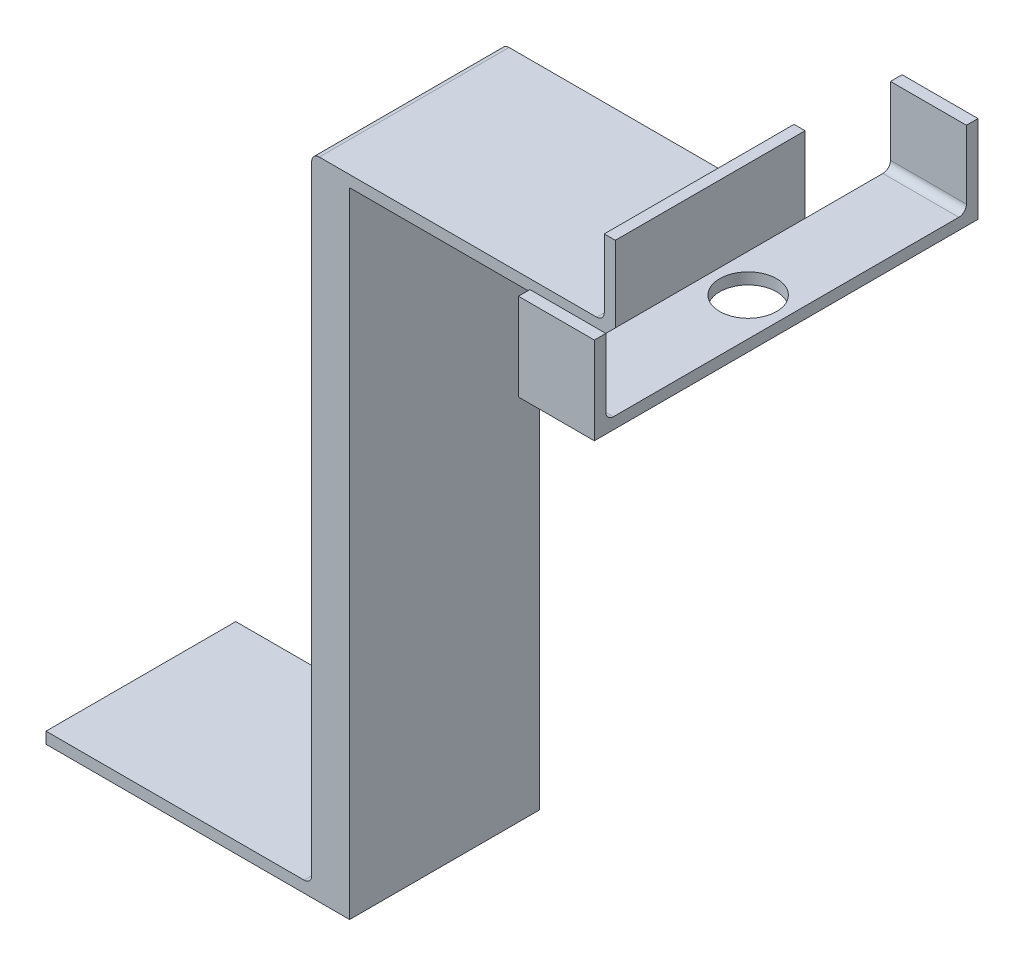
ISO-10303-21;
HEADER;
FILE_DESCRIPTION(('STEP AP214'),'2;1');
FILE_NAME('part.step','',(''),(''),'','','');
FILE_SCHEMA(('AUTOMOTIVE_DESIGN { 1 0 10303 214 1 1 1 1 }'));
ENDSEC;
DATA;
#1=APPLICATION_CONTEXT('core data for automotive mechanical design processes');
#2=APPLICATION_PROTOCOL_DEFINITION('international standard','automotive_design',2000,#1);
#3=PRODUCT_CONTEXT('',#1,'mechanical');
#4=PRODUCT('Part','Part','',(#3));
#5=PRODUCT_RELATED_PRODUCT_CATEGORY('part','',(#4));
#6=PRODUCT_DEFINITION_FORMATION('','',#4);
#7=PRODUCT_DEFINITION_CONTEXT('part definition',#1,'design');
#8=PRODUCT_DEFINITION('design','',#6,#7);
#9=PRODUCT_DEFINITION_SHAPE('','',#8);
#10=(LENGTH_UNIT() NAMED_UNIT(*) SI_UNIT(.MILLI.,.METRE.));
#11=(NAMED_UNIT(*) PLANE_ANGLE_UNIT() SI_UNIT($,.RADIAN.));
#12=(NAMED_UNIT(*) SI_UNIT($,.STERADIAN.) SOLID_ANGLE_UNIT());
#13=UNCERTAINTY_MEASURE_WITH_UNIT(LENGTH_MEASURE(1.E-05),#10,'distance_accuracy_value','');
#14=(GEOMETRIC_REPRESENTATION_CONTEXT(3) GLOBAL_UNCERTAINTY_ASSIGNED_CONTEXT((#13)) GLOBAL_UNIT_ASSIGNED_CONTEXT((#10,
#11,#12)) REPRESENTATION_CONTEXT('',''));
#15=CARTESIAN_POINT('',(0.,0.,0.));
#16=DIRECTION('',(0.,0.,1.));
#17=DIRECTION('',(1.,0.,0.));
#18=AXIS2_PLACEMENT_3D('',#15,#16,#17);
#19=CARTESIAN_POINT('',(0.,215.9,0.));
#20=DIRECTION('',(0.,-1.,0.));
#21=DIRECTION('',(0.,0.,-1.));
#22=AXIS2_PLACEMENT_3D('',#19,#20,#21);
#23=PLANE('',#22);
#24=CARTESIAN_POINT('',(203.2,215.9,31.75));
#25=DIRECTION('',(0.,1.,0.));
#26=DIRECTION('',(0.,0.,1.));
#27=AXIS2_PLACEMENT_3D('',#24,#25,#26);
#28=CIRCLE('',#27,9.525);
#29=CARTESIAN_POINT('',(203.2,215.9,41.275));
#30=VERTEX_POINT('',#29);
#31=EDGE_CURVE('E252',#30,#30,#28,.T.);
#32=ORIENTED_EDGE('',*,*,#31,.F.);
#33=EDGE_LOOP('',(#32));
#34=FACE_BOUND('',#33,.T.);
#35=DIRECTION('',(0.,0.,1.));
#36=VECTOR('',#35,1.);
#37=CARTESIAN_POINT('',(190.5,215.9,92.075));
#38=LINE('',#37,#36);
#39=CARTESIAN_POINT('',(190.5,215.9,63.5));
#40=VERTEX_POINT('',#39);
#41=CARTESIAN_POINT('',(190.5,215.9,89.535));
#42=VERTEX_POINT('',#41);
#43=EDGE_CURVE('E264',#40,#42,#38,.T.);
#44=ORIENTED_EDGE('',*,*,#43,.T.);
#45=DIRECTION('',(-1.,0.,0.));
#46=VECTOR('',#45,1.);
#47=CARTESIAN_POINT('',(215.9,215.9,89.535));
#48=LINE('',#47,#46);
#49=CARTESIAN_POINT('',(215.9,215.9,89.535));
#50=VERTEX_POINT('',#49);
#51=EDGE_CURVE('E362',#42,#50,#48,.F.);
#52=ORIENTED_EDGE('',*,*,#51,.T.);
#53=DIRECTION('',(0.,0.,-1.));
#54=VECTOR('',#53,1.);
#55=CARTESIAN_POINT('',(215.9,215.9,-28.575));
#56=LINE('',#55,#54);
#57=CARTESIAN_POINT('',(215.9,215.9,-26.035));
#58=VERTEX_POINT('',#57);
#59=EDGE_CURVE('E281',#50,#58,#56,.T.);
#60=ORIENTED_EDGE('',*,*,#59,.T.);
#61=DIRECTION('',(-1.,0.,0.));
#62=VECTOR('',#61,1.);
#63=CARTESIAN_POINT('',(190.5,215.9,-26.035));
#64=LINE('',#63,#62);
#65=CARTESIAN_POINT('',(190.5,215.9,-26.035));
#66=VERTEX_POINT('',#65);
#67=EDGE_CURVE('E359',#58,#66,#64,.T.);
#68=ORIENTED_EDGE('',*,*,#67,.T.);
#69=DIRECTION('',(0.,0.,1.));
#70=VECTOR('',#69,1.);
#71=CARTESIAN_POINT('',(190.5,215.9,-28.575));
#72=LINE('',#71,#70);
#73=CARTESIAN_POINT('',(190.5,215.9,0.));
#74=VERTEX_POINT('',#73);
#75=EDGE_CURVE('E271',#66,#74,#72,.T.);
#76=ORIENTED_EDGE('',*,*,#75,.T.);
#77=DIRECTION('',(0.,0.,-1.));
#78=VECTOR('',#77,1.);
#79=CARTESIAN_POINT('',(190.5,215.9,0.));
#80=LINE('',#79,#78);
#81=EDGE_CURVE('E249',#40,#74,#80,.T.);
#82=ORIENTED_EDGE('',*,*,#81,.F.);
#83=EDGE_LOOP('',(#44,#52,#60,#68,#76,#82));
#84=FACE_BOUND('',#83,.T.);
#85=ADVANCED_FACE('F37',(#34,#84),#23,.F.);
#86=CARTESIAN_POINT('',(215.9,241.3,-28.575));
#87=DIRECTION('',(0.,0.,-1.));
#88=DIRECTION('',(-1.,0.,0.));
#89=AXIS2_PLACEMENT_3D('',#86,#87,#88);
#90=PLANE('',#89);
#91=DIRECTION('',(0.,-1.,0.));
#92=VECTOR('',#91,1.);
#93=CARTESIAN_POINT('',(190.5,241.3,-28.575));
#94=LINE('',#93,#92);
#95=CARTESIAN_POINT('',(190.5,241.3,-28.575));
#96=VERTEX_POINT('',#95);
#97=CARTESIAN_POINT('',(190.5,218.44,-28.575));
#98=VERTEX_POINT('',#97);
#99=EDGE_CURVE('E341',#96,#98,#94,.T.);
#100=ORIENTED_EDGE('',*,*,#99,.T.);
#101=DIRECTION('',(-1.,0.,0.));
#102=VECTOR('',#101,1.);
#103=CARTESIAN_POINT('',(215.9,218.44,-28.575));
#104=LINE('',#103,#102);
#105=CARTESIAN_POINT('',(215.9,218.44,-28.575));
#106=VERTEX_POINT('',#105);
#107=EDGE_CURVE('E364',#98,#106,#104,.F.);
#108=ORIENTED_EDGE('',*,*,#107,.T.);
#109=DIRECTION('',(0.,-1.,0.));
#110=VECTOR('',#109,1.);
#111=CARTESIAN_POINT('',(215.9,241.3,-28.575));
#112=LINE('',#111,#110);
#113=CARTESIAN_POINT('',(215.9,241.3,-28.575));
#114=VERTEX_POINT('',#113);
#115=EDGE_CURVE('E344',#114,#106,#112,.T.);
#116=ORIENTED_EDGE('',*,*,#115,.F.);
#117=DIRECTION('',(1.,0.,0.));
#118=VECTOR('',#117,1.);
#119=CARTESIAN_POINT('',(215.9,241.3,-28.575));
#120=LINE('',#119,#118);
#121=EDGE_CURVE('E347',#96,#114,#120,.T.);
#122=ORIENTED_EDGE('',*,*,#121,.F.);
#123=EDGE_LOOP('',(#100,#108,#116,#122));
#124=FACE_BOUND('',#123,.T.);
#125=ADVANCED_FACE('F459',(#124),#90,.F.);
#126=CARTESIAN_POINT('',(215.9,241.3,-28.575));
#127=DIRECTION('',(-1.,0.,0.));
#128=DIRECTION('',(0.,0.,1.));
#129=AXIS2_PLACEMENT_3D('',#126,#127,#128);
#130=PLANE('',#129);
#131=ORIENTED_EDGE('',*,*,#115,.T.);
#132=CARTESIAN_POINT('',(215.9,218.44,-26.035));
#133=DIRECTION('',(-1.,0.,0.));
#134=DIRECTION('',(0.,0.,1.));
#135=AXIS2_PLACEMENT_3D('',#132,#133,#134);
#136=CIRCLE('',#135,2.54);
#137=EDGE_CURVE('E390',#106,#58,#136,.T.);
#138=ORIENTED_EDGE('',*,*,#137,.T.);
#139=ORIENTED_EDGE('',*,*,#59,.F.);
#140=CARTESIAN_POINT('',(215.9,218.44,89.535));
#141=DIRECTION('',(-1.,0.,0.));
#142=DIRECTION('',(0.,0.,1.));
#143=AXIS2_PLACEMENT_3D('',#140,#141,#142);
#144=CIRCLE('',#143,2.54);
#145=CARTESIAN_POINT('',(215.9,218.44,92.075));
#146=VERTEX_POINT('',#145);
#147=EDGE_CURVE('E386',#50,#146,#144,.T.);
#148=ORIENTED_EDGE('',*,*,#147,.T.);
#149=DIRECTION('',(0.,-1.,0.));
#150=VECTOR('',#149,1.);
#151=CARTESIAN_POINT('',(215.9,241.3,92.075));
#152=LINE('',#151,#150);
#153=CARTESIAN_POINT('',(215.9,241.3,92.075));
#154=VERTEX_POINT('',#153);
#155=EDGE_CURVE('E231',#154,#146,#152,.T.);
#156=ORIENTED_EDGE('',*,*,#155,.F.);
#157=DIRECTION('',(0.,0.,-1.));
#158=VECTOR('',#157,1.);
#159=CARTESIAN_POINT('',(215.9,241.3,92.075));
#160=LINE('',#159,#158);
#161=CARTESIAN_POINT('',(215.9,241.3,95.9160839160832));
#162=VERTEX_POINT('',#161);
#163=EDGE_CURVE('E219',#162,#154,#160,.T.);
#164=ORIENTED_EDGE('',*,*,#163,.F.);
#165=DIRECTION('',(0.,1.,0.));
#166=VECTOR('',#165,1.);
#167=CARTESIAN_POINT('',(215.9,212.09,95.9160839160832));
#168=LINE('',#167,#166);
#169=CARTESIAN_POINT('',(215.9,212.09,95.9160839160832));
#170=VERTEX_POINT('',#169);
#171=EDGE_CURVE('E211',#170,#162,#168,.T.);
#172=ORIENTED_EDGE('',*,*,#171,.F.);
#173=DIRECTION('',(0.,0.,1.));
#174=VECTOR('',#173,1.);
#175=CARTESIAN_POINT('',(215.9,212.09,-32.4607336475015));
#176=LINE('',#175,#174);
#177=CARTESIAN_POINT('',(215.9,212.09,-32.4607336475015));
#178=VERTEX_POINT('',#177);
#179=EDGE_CURVE('E329',#178,#170,#176,.T.);
#180=ORIENTED_EDGE('',*,*,#179,.F.);
#181=DIRECTION('',(0.,-1.,0.));
#182=VECTOR('',#181,1.);
#183=CARTESIAN_POINT('',(215.9,241.3,-32.4607336475015));
#184=LINE('',#183,#182);
#185=CARTESIAN_POINT('',(215.9,241.3,-32.4607336475015));
#186=VERTEX_POINT('',#185);
#187=EDGE_CURVE('E337',#186,#178,#184,.T.);
#188=ORIENTED_EDGE('',*,*,#187,.F.);
#189=DIRECTION('',(0.,0.,-1.));
#190=VECTOR('',#189,1.);
#191=CARTESIAN_POINT('',(215.9,241.3,-28.575));
#192=LINE('',#191,#190);
#193=EDGE_CURVE('E353',#114,#186,#192,.T.);
#194=ORIENTED_EDGE('',*,*,#193,.F.);
#195=EDGE_LOOP('',(#131,#138,#139,#148,#156,#164,#172,#180,#188,#194));
#196=FACE_BOUND('',#195,.T.);
#197=ADVANCED_FACE('F446',(#196),#130,.F.);
#198=CARTESIAN_POINT('',(215.9,241.3,-32.4607336475015));
#199=DIRECTION('',(0.,0.,1.));
#200=DIRECTION('',(1.,0.,0.));
#201=AXIS2_PLACEMENT_3D('',#198,#199,#200);
#202=PLANE('',#201);
#203=ORIENTED_EDGE('',*,*,#187,.T.);
#204=DIRECTION('',(1.,0.,0.));
#205=VECTOR('',#204,1.);
#206=CARTESIAN_POINT('',(215.9,212.09,-32.4607336475015));
#207=LINE('',#206,#205);
#208=CARTESIAN_POINT('',(190.5,212.09,-32.4607336475015));
#209=VERTEX_POINT('',#208);
#210=EDGE_CURVE('E334',#209,#178,#207,.T.);
#211=ORIENTED_EDGE('',*,*,#210,.F.);
#212=DIRECTION('',(0.,-1.,0.));
#213=VECTOR('',#212,1.);
#214=CARTESIAN_POINT('',(190.5,241.3,-32.4607336475015));
#215=LINE('',#214,#213);
#216=CARTESIAN_POINT('',(190.5,241.3,-32.4607336475015));
#217=VERTEX_POINT('',#216);
#218=EDGE_CURVE('E339',#217,#209,#215,.T.);
#219=ORIENTED_EDGE('',*,*,#218,.F.);
#220=DIRECTION('',(-1.,0.,0.));
#221=VECTOR('',#220,1.);
#222=CARTESIAN_POINT('',(215.9,241.3,-32.4607336475015));
#223=LINE('',#222,#221);
#224=EDGE_CURVE('E351',#186,#217,#223,.T.);
#225=ORIENTED_EDGE('',*,*,#224,.F.);
#226=EDGE_LOOP('',(#203,#211,#219,#225));
#227=FACE_BOUND('',#226,.T.);
#228=ADVANCED_FACE('F473',(#227),#202,.F.);
#229=CARTESIAN_POINT('',(190.5,241.3,-28.575));
#230=DIRECTION('',(1.,0.,0.));
#231=DIRECTION('',(0.,0.,-1.));
#232=AXIS2_PLACEMENT_3D('',#229,#230,#231);
#233=PLANE('',#232);
#234=ORIENTED_EDGE('',*,*,#218,.T.);
#235=DIRECTION('',(0.,0.,-1.));
#236=VECTOR('',#235,1.);
#237=CARTESIAN_POINT('',(190.5,212.09,-32.4607336475015));
#238=LINE('',#237,#236);
#239=CARTESIAN_POINT('',(190.5,212.09,0.));
#240=VERTEX_POINT('',#239);
#241=EDGE_CURVE('E331',#240,#209,#238,.T.);
#242=ORIENTED_EDGE('',*,*,#241,.F.);
#243=DIRECTION('',(0.,1.,0.));
#244=VECTOR('',#243,1.);
#245=CARTESIAN_POINT('',(190.5,212.09,0.));
#246=LINE('',#245,#244);
#247=EDGE_CURVE('E285',#240,#74,#246,.T.);
#248=ORIENTED_EDGE('',*,*,#247,.T.);
#249=ORIENTED_EDGE('',*,*,#75,.F.);
#250=CARTESIAN_POINT('',(190.5,218.44,-26.035));
#251=DIRECTION('',(1.,0.,0.));
#252=DIRECTION('',(0.,0.,-1.));
#253=AXIS2_PLACEMENT_3D('',#250,#251,#252);
#254=CIRCLE('',#253,2.54);
#255=EDGE_CURVE('E388',#66,#98,#254,.T.);
#256=ORIENTED_EDGE('',*,*,#255,.T.);
#257=ORIENTED_EDGE('',*,*,#99,.F.);
#258=DIRECTION('',(0.,0.,1.));
#259=VECTOR('',#258,1.);
#260=CARTESIAN_POINT('',(190.5,241.3,-28.575));
#261=LINE('',#260,#259);
#262=EDGE_CURVE('E349',#217,#96,#261,.T.);
#263=ORIENTED_EDGE('',*,*,#262,.F.);
#264=EDGE_LOOP('',(#234,#242,#248,#249,#256,#257,#263));
#265=FACE_BOUND('',#264,.T.);
#266=ADVANCED_FACE('F455',(#265),#233,.F.);
#267=CARTESIAN_POINT('',(0.,241.3,0.));
#268=DIRECTION('',(0.,1.,0.));
#269=DIRECTION('',(0.,0.,1.));
#270=AXIS2_PLACEMENT_3D('',#267,#268,#269);
#271=PLANE('',#270);
#272=ORIENTED_EDGE('',*,*,#193,.T.);
#273=ORIENTED_EDGE('',*,*,#224,.T.);
#274=ORIENTED_EDGE('',*,*,#262,.T.);
#275=ORIENTED_EDGE('',*,*,#121,.T.);
#276=EDGE_LOOP('',(#272,#273,#274,#275));
#277=FACE_BOUND('',#276,.T.);
#278=ADVANCED_FACE('F463',(#277),#271,.T.);
#279=CARTESIAN_POINT('',(0.,212.09,0.));
#280=DIRECTION('',(0.,-1.,0.));
#281=DIRECTION('',(0.,0.,-1.));
#282=AXIS2_PLACEMENT_3D('',#279,#280,#281);
#283=PLANE('',#282);
#284=ORIENTED_EDGE('',*,*,#179,.T.);
#285=DIRECTION('',(-1.,0.,0.));
#286=VECTOR('',#285,1.);
#287=CARTESIAN_POINT('',(190.5,212.09,95.9160839160832));
#288=LINE('',#287,#286);
#289=CARTESIAN_POINT('',(190.5,212.09,95.9160839160832));
#290=VERTEX_POINT('',#289);
#291=EDGE_CURVE('E210',#170,#290,#288,.T.);
#292=ORIENTED_EDGE('',*,*,#291,.T.);
#293=DIRECTION('',(0.,0.,1.));
#294=VECTOR('',#293,1.);
#295=CARTESIAN_POINT('',(190.5,212.09,92.075));
#296=LINE('',#295,#294);
#297=CARTESIAN_POINT('',(190.5,212.09,63.5));
#298=VERTEX_POINT('',#297);
#299=EDGE_CURVE('E206',#298,#290,#296,.T.);
#300=ORIENTED_EDGE('',*,*,#299,.F.);
#301=DIRECTION('',(1.,0.,0.));
#302=VECTOR('',#301,1.);
#303=CARTESIAN_POINT('',(101.6,212.09,63.5));
#304=LINE('',#303,#302);
#305=CARTESIAN_POINT('',(101.6,212.09,63.5));
#306=VERTEX_POINT('',#305);
#307=EDGE_CURVE('E270',#306,#298,#304,.T.);
#308=ORIENTED_EDGE('',*,*,#307,.F.);
#309=DIRECTION('',(0.,0.,1.));
#310=VECTOR('',#309,1.);
#311=CARTESIAN_POINT('',(101.6,212.09,0.));
#312=LINE('',#311,#310);
#313=CARTESIAN_POINT('',(101.6,212.09,0.));
#314=VERTEX_POINT('',#313);
#315=EDGE_CURVE('E267',#314,#306,#312,.T.);
#316=ORIENTED_EDGE('',*,*,#315,.F.);
#317=DIRECTION('',(-1.,0.,0.));
#318=VECTOR('',#317,1.);
#319=CARTESIAN_POINT('',(101.6,212.09,0.));
#320=LINE('',#319,#318);
#321=EDGE_CURVE('E275',#240,#314,#320,.T.);
#322=ORIENTED_EDGE('',*,*,#321,.F.);
#323=ORIENTED_EDGE('',*,*,#241,.T.);
#324=ORIENTED_EDGE('',*,*,#210,.T.);
#325=EDGE_LOOP('',(#284,#292,#300,#308,#316,#322,#323,#324));
#326=FACE_BOUND('',#325,.T.);
#327=CARTESIAN_POINT('',(203.2,212.09,31.75));
#328=DIRECTION('',(0.,1.,0.));
#329=DIRECTION('',(0.,0.,1.));
#330=AXIS2_PLACEMENT_3D('',#327,#328,#329);
#331=CIRCLE('',#330,9.525);
#332=CARTESIAN_POINT('',(203.2,212.09,41.275));
#333=VERTEX_POINT('',#332);
#334=EDGE_CURVE('E261',#333,#333,#331,.T.);
#335=ORIENTED_EDGE('',*,*,#334,.T.);
#336=EDGE_LOOP('',(#335));
#337=FACE_BOUND('',#336,.T.);
#338=ADVANCED_FACE('F470',(#326,#337),#283,.T.);
#339=DIRECTION('',(1.,0.,0.));
#340=VECTOR('',#339,1.);
#341=CARTESIAN_POINT('',(101.6,215.9,63.5));
#342=LINE('',#341,#340);
#343=CARTESIAN_POINT('',(91.44,215.9,63.5));
#344=VERTEX_POINT('',#343);
#345=CARTESIAN_POINT('',(184.259133749134,215.9,63.5));
#346=VERTEX_POINT('',#345);
#347=EDGE_CURVE('E293',#344,#346,#342,.T.);
#348=ORIENTED_EDGE('',*,*,#347,.T.);
#349=DIRECTION('',(0.,0.,1.));
#350=VECTOR('',#349,1.);
#351=CARTESIAN_POINT('',(184.259133749134,215.9,0.));
#352=LINE('',#351,#350);
#353=CARTESIAN_POINT('',(184.259133749134,215.9,0.));
#354=VERTEX_POINT('',#353);
#355=EDGE_CURVE('E372',#346,#354,#352,.F.);
#356=ORIENTED_EDGE('',*,*,#355,.T.);
#357=DIRECTION('',(-1.,0.,0.));
#358=VECTOR('',#357,1.);
#359=CARTESIAN_POINT('',(101.6,215.9,0.));
#360=LINE('',#359,#358);
#361=CARTESIAN_POINT('',(91.44,215.9,0.));
#362=VERTEX_POINT('',#361);
#363=EDGE_CURVE('E288',#354,#362,#360,.T.);
#364=ORIENTED_EDGE('',*,*,#363,.T.);
#365=DIRECTION('',(0.,0.,1.));
#366=VECTOR('',#365,1.);
#367=CARTESIAN_POINT('',(91.44,215.9,0.));
#368=LINE('',#367,#366);
#369=EDGE_CURVE('E369',#362,#344,#368,.T.);
#370=ORIENTED_EDGE('',*,*,#369,.T.);
#371=EDGE_LOOP('',(#348,#356,#364,#370));
#372=FACE_BOUND('',#371,.T.);
#373=ADVANCED_FACE('F414',(#372),#23,.F.);
#374=CARTESIAN_POINT('',(0.,3.80999999999999,0.));
#375=DIRECTION('',(1.,0.,0.));
#376=DIRECTION('',(0.,0.,-1.));
#377=AXIS2_PLACEMENT_3D('',#374,#375,#376);
#378=PLANE('',#377);
#379=DIRECTION('',(0.,0.,1.));
#380=VECTOR('',#379,1.);
#381=CARTESIAN_POINT('',(0.,0.,0.));
#382=LINE('',#381,#380);
#383=CARTESIAN_POINT('',(0.,0.,0.));
#384=VERTEX_POINT('',#383);
#385=CARTESIAN_POINT('',(0.,0.,63.5));
#386=VERTEX_POINT('',#385);
#387=EDGE_CURVE('E301',#384,#386,#382,.T.);
#388=ORIENTED_EDGE('',*,*,#387,.T.);
#389=DIRECTION('',(0.,-1.,0.));
#390=VECTOR('',#389,1.);
#391=CARTESIAN_POINT('',(0.,3.80999999999999,63.5));
#392=LINE('',#391,#390);
#393=CARTESIAN_POINT('',(0.,3.80999999999999,63.5));
#394=VERTEX_POINT('',#393);
#395=EDGE_CURVE('E326',#394,#386,#392,.T.);
#396=ORIENTED_EDGE('',*,*,#395,.F.);
#397=DIRECTION('',(0.,0.,1.));
#398=VECTOR('',#397,1.);
#399=CARTESIAN_POINT('',(0.,3.80999999999999,0.));
#400=LINE('',#399,#398);
#401=CARTESIAN_POINT('',(0.,3.80999999999999,0.));
#402=VERTEX_POINT('',#401);
#403=EDGE_CURVE('E302',#402,#394,#400,.T.);
#404=ORIENTED_EDGE('',*,*,#403,.F.);
#405=DIRECTION('',(0.,-1.,0.));
#406=VECTOR('',#405,1.);
#407=CARTESIAN_POINT('',(0.,3.80999999999999,0.));
#408=LINE('',#407,#406);
#409=EDGE_CURVE('E310',#402,#384,#408,.T.);
#410=ORIENTED_EDGE('',*,*,#409,.T.);
#411=EDGE_LOOP('',(#388,#396,#404,#410));
#412=FACE_BOUND('',#411,.T.);
#413=ADVANCED_FACE('F484',(#412),#378,.F.);
#414=CARTESIAN_POINT('',(0.,3.80999999999999,63.5));
#415=DIRECTION('',(0.,0.,-1.));
#416=DIRECTION('',(-1.,0.,0.));
#417=AXIS2_PLACEMENT_3D('',#414,#415,#416);
#418=PLANE('',#417);
#419=ORIENTED_EDGE('',*,*,#347,.F.);
#420=CARTESIAN_POINT('',(91.44,213.36,63.5));
#421=DIRECTION('',(0.,0.,-1.));
#422=DIRECTION('',(-1.,0.,0.));
#423=AXIS2_PLACEMENT_3D('',#420,#421,#422);
#424=CIRCLE('',#423,2.54);
#425=CARTESIAN_POINT('',(88.9,213.36,63.5));
#426=VERTEX_POINT('',#425);
#427=EDGE_CURVE('E374',#344,#426,#424,.F.);
#428=ORIENTED_EDGE('',*,*,#427,.T.);
#429=DIRECTION('',(0.,-1.,0.));
#430=VECTOR('',#429,1.);
#431=CARTESIAN_POINT('',(88.9,215.9,63.5));
#432=LINE('',#431,#430);
#433=CARTESIAN_POINT('',(88.9,6.35000000000005,63.5));
#434=VERTEX_POINT('',#433);
#435=EDGE_CURVE('E296',#426,#434,#432,.T.);
#436=ORIENTED_EDGE('',*,*,#435,.T.);
#437=CARTESIAN_POINT('',(86.36,6.34999999999999,63.5));
#438=DIRECTION('',(0.,0.,-1.));
#439=DIRECTION('',(-1.,0.,0.));
#440=AXIS2_PLACEMENT_3D('',#437,#438,#439);
#441=CIRCLE('',#440,2.54);
#442=CARTESIAN_POINT('',(86.36,3.80999999999999,63.5));
#443=VERTEX_POINT('',#442);
#444=EDGE_CURVE('E45',#434,#443,#441,.T.);
#445=ORIENTED_EDGE('',*,*,#444,.T.);
#446=DIRECTION('',(1.,0.,0.));
#447=VECTOR('',#446,1.);
#448=CARTESIAN_POINT('',(0.,3.80999999999999,63.5));
#449=LINE('',#448,#447);
#450=EDGE_CURVE('E305',#394,#443,#449,.T.);
#451=ORIENTED_EDGE('',*,*,#450,.F.);
#452=ORIENTED_EDGE('',*,*,#395,.T.);
#453=DIRECTION('',(1.,0.,0.));
#454=VECTOR('',#453,1.);
#455=CARTESIAN_POINT('',(0.,0.,63.5));
#456=LINE('',#455,#454);
#457=CARTESIAN_POINT('',(101.6,0.,63.5));
#458=VERTEX_POINT('',#457);
#459=EDGE_CURVE('E313',#386,#458,#456,.T.);
#460=ORIENTED_EDGE('',*,*,#459,.T.);
#461=DIRECTION('',(0.,-1.,0.));
#462=VECTOR('',#461,1.);
#463=CARTESIAN_POINT('',(101.6,3.80999999999999,63.5));
#464=LINE('',#463,#462);
#465=EDGE_CURVE('E324',#306,#458,#464,.T.);
#466=ORIENTED_EDGE('',*,*,#465,.F.);
#467=ORIENTED_EDGE('',*,*,#307,.T.);
#468=DIRECTION('',(0.,1.,0.));
#469=VECTOR('',#468,1.);
#470=CARTESIAN_POINT('',(190.5,212.09,63.5));
#471=LINE('',#470,#469);
#472=EDGE_CURVE('E278',#298,#40,#471,.T.);
#473=ORIENTED_EDGE('',*,*,#472,.T.);
#474=DIRECTION('',(0.,-1.,0.));
#475=VECTOR('',#474,1.);
#476=CARTESIAN_POINT('',(190.5,241.3,63.5));
#477=LINE('',#476,#475);
#478=CARTESIAN_POINT('',(190.5,241.3,63.5));
#479=VERTEX_POINT('',#478);
#480=EDGE_CURVE('E242',#479,#40,#477,.T.);
#481=ORIENTED_EDGE('',*,*,#480,.F.);
#482=DIRECTION('',(1.,0.,0.));
#483=VECTOR('',#482,1.);
#484=CARTESIAN_POINT('',(190.5,241.3,63.5));
#485=LINE('',#484,#483);
#486=CARTESIAN_POINT('',(186.799133749134,241.3,63.5));
#487=VERTEX_POINT('',#486);
#488=EDGE_CURVE('E255',#487,#479,#485,.T.);
#489=ORIENTED_EDGE('',*,*,#488,.F.);
#490=DIRECTION('',(0.,-1.,0.));
#491=VECTOR('',#490,1.);
#492=CARTESIAN_POINT('',(186.799133749134,241.3,63.5));
#493=LINE('',#492,#491);
#494=CARTESIAN_POINT('',(186.799133749134,218.44,63.5));
#495=VERTEX_POINT('',#494);
#496=EDGE_CURVE('E239',#487,#495,#493,.T.);
#497=ORIENTED_EDGE('',*,*,#496,.T.);
#498=CARTESIAN_POINT('',(184.259133749134,218.44,63.5));
#499=DIRECTION('',(0.,0.,-1.));
#500=DIRECTION('',(-1.,0.,0.));
#501=AXIS2_PLACEMENT_3D('',#498,#499,#500);
#502=CIRCLE('',#501,2.54);
#503=EDGE_CURVE('E392',#495,#346,#502,.T.);
#504=ORIENTED_EDGE('',*,*,#503,.T.);
#505=EDGE_LOOP('',(#419,#428,#436,#445,#451,#452,#460,#466,#467,#473,#481,#489,#497,#504));
#506=FACE_BOUND('',#505,.T.);
#507=ADVANCED_FACE('F397',(#506),#418,.F.);
#508=CARTESIAN_POINT('',(101.6,3.80999999999999,0.));
#509=DIRECTION('',(-1.,0.,0.));
#510=DIRECTION('',(0.,0.,1.));
#511=AXIS2_PLACEMENT_3D('',#508,#509,#510);
#512=PLANE('',#511);
#513=DIRECTION('',(0.,-1.,0.));
#514=VECTOR('',#513,1.);
#515=CARTESIAN_POINT('',(101.6,3.80999999999999,0.));
#516=LINE('',#515,#514);
#517=CARTESIAN_POINT('',(101.6,0.,0.));
#518=VERTEX_POINT('',#517);
#519=EDGE_CURVE('E322',#314,#518,#516,.T.);
#520=ORIENTED_EDGE('',*,*,#519,.F.);
#521=ORIENTED_EDGE('',*,*,#315,.T.);
#522=ORIENTED_EDGE('',*,*,#465,.T.);
#523=DIRECTION('',(0.,0.,-1.));
#524=VECTOR('',#523,1.);
#525=CARTESIAN_POINT('',(101.6,0.,0.));
#526=LINE('',#525,#524);
#527=EDGE_CURVE('E316',#458,#518,#526,.T.);
#528=ORIENTED_EDGE('',*,*,#527,.T.);
#529=EDGE_LOOP('',(#520,#521,#522,#528));
#530=FACE_BOUND('',#529,.T.);
#531=ADVANCED_FACE('F476',(#530),#512,.F.);
#532=CARTESIAN_POINT('',(0.,3.80999999999999,0.));
#533=DIRECTION('',(0.,0.,1.));
#534=DIRECTION('',(1.,0.,0.));
#535=AXIS2_PLACEMENT_3D('',#532,#533,#534);
#536=PLANE('',#535);
#537=DIRECTION('',(0.,-1.,0.));
#538=VECTOR('',#537,1.);
#539=CARTESIAN_POINT('',(88.9,215.9,0.));
#540=LINE('',#539,#538);
#541=CARTESIAN_POINT('',(88.9,213.36,0.));
#542=VERTEX_POINT('',#541);
#543=CARTESIAN_POINT('',(88.9,6.35000000000005,0.));
#544=VERTEX_POINT('',#543);
#545=EDGE_CURVE('E299',#542,#544,#540,.T.);
#546=ORIENTED_EDGE('',*,*,#545,.F.);
#547=CARTESIAN_POINT('',(91.44,213.36,0.));
#548=DIRECTION('',(0.,0.,1.));
#549=DIRECTION('',(1.,0.,0.));
#550=AXIS2_PLACEMENT_3D('',#547,#548,#549);
#551=CIRCLE('',#550,2.54);
#552=EDGE_CURVE('E381',#542,#362,#551,.F.);
#553=ORIENTED_EDGE('',*,*,#552,.T.);
#554=ORIENTED_EDGE('',*,*,#363,.F.);
#555=CARTESIAN_POINT('',(184.259133749134,218.44,0.));
#556=DIRECTION('',(0.,0.,1.));
#557=DIRECTION('',(1.,0.,0.));
#558=AXIS2_PLACEMENT_3D('',#555,#556,#557);
#559=CIRCLE('',#558,2.54);
#560=CARTESIAN_POINT('',(186.799133749134,218.44,0.));
#561=VERTEX_POINT('',#560);
#562=EDGE_CURVE('E394',#354,#561,#559,.T.);
#563=ORIENTED_EDGE('',*,*,#562,.T.);
#564=DIRECTION('',(0.,-1.,0.));
#565=VECTOR('',#564,1.);
#566=CARTESIAN_POINT('',(186.799133749134,241.3,0.));
#567=LINE('',#566,#565);
#568=CARTESIAN_POINT('',(186.799133749134,241.3,0.));
#569=VERTEX_POINT('',#568);
#570=EDGE_CURVE('E236',#569,#561,#567,.T.);
#571=ORIENTED_EDGE('',*,*,#570,.F.);
#572=DIRECTION('',(-1.,0.,0.));
#573=VECTOR('',#572,1.);
#574=CARTESIAN_POINT('',(186.799133749134,241.3,0.));
#575=LINE('',#574,#573);
#576=CARTESIAN_POINT('',(190.5,241.3,0.));
#577=VERTEX_POINT('',#576);
#578=EDGE_CURVE('E253',#577,#569,#575,.T.);
#579=ORIENTED_EDGE('',*,*,#578,.F.);
#580=DIRECTION('',(0.,-1.,0.));
#581=VECTOR('',#580,1.);
#582=CARTESIAN_POINT('',(190.5,241.3,0.));
#583=LINE('',#582,#581);
#584=EDGE_CURVE('E245',#577,#74,#583,.T.);
#585=ORIENTED_EDGE('',*,*,#584,.T.);
#586=ORIENTED_EDGE('',*,*,#247,.F.);
#587=ORIENTED_EDGE('',*,*,#321,.T.);
#588=ORIENTED_EDGE('',*,*,#519,.T.);
#589=DIRECTION('',(-1.,0.,0.));
#590=VECTOR('',#589,1.);
#591=CARTESIAN_POINT('',(0.,0.,0.));
#592=LINE('',#591,#590);
#593=EDGE_CURVE('E306',#518,#384,#592,.T.);
#594=ORIENTED_EDGE('',*,*,#593,.T.);
#595=ORIENTED_EDGE('',*,*,#409,.F.);
#596=DIRECTION('',(-1.,0.,0.));
#597=VECTOR('',#596,1.);
#598=CARTESIAN_POINT('',(0.,3.80999999999999,0.));
#599=LINE('',#598,#597);
#600=CARTESIAN_POINT('',(86.36,3.80999999999999,0.));
#601=VERTEX_POINT('',#600);
#602=EDGE_CURVE('E308',#601,#402,#599,.T.);
#603=ORIENTED_EDGE('',*,*,#602,.F.);
#604=CARTESIAN_POINT('',(86.36,6.34999999999999,0.));
#605=DIRECTION('',(0.,0.,1.));
#606=DIRECTION('',(1.,0.,0.));
#607=AXIS2_PLACEMENT_3D('',#604,#605,#606);
#608=CIRCLE('',#607,2.54);
#609=EDGE_CURVE('E11',#601,#544,#608,.T.);
#610=ORIENTED_EDGE('',*,*,#609,.T.);
#611=EDGE_LOOP('',(#546,#553,#554,#563,#571,#579,#585,#586,#587,#588,#594,#595,#603,#610));
#612=FACE_BOUND('',#611,.T.);
#613=ADVANCED_FACE('F408',(#612),#536,.F.);
#614=CARTESIAN_POINT('',(0.,3.80999999999999,0.));
#615=DIRECTION('',(0.,1.,0.));
#616=DIRECTION('',(0.,0.,1.));
#617=AXIS2_PLACEMENT_3D('',#614,#615,#616);
#618=PLANE('',#617);
#619=ORIENTED_EDGE('',*,*,#450,.T.);
#620=DIRECTION('',(0.,0.,1.));
#621=VECTOR('',#620,1.);
#622=CARTESIAN_POINT('',(86.36,3.80999999999999,0.));
#623=LINE('',#622,#621);
#624=EDGE_CURVE('E52',#443,#601,#623,.F.);
#625=ORIENTED_EDGE('',*,*,#624,.T.);
#626=ORIENTED_EDGE('',*,*,#602,.T.);
#627=ORIENTED_EDGE('',*,*,#403,.T.);
#628=EDGE_LOOP('',(#619,#625,#626,#627));
#629=FACE_BOUND('',#628,.T.);
#630=ADVANCED_FACE('F401',(#629),#618,.T.);
#631=CARTESIAN_POINT('',(0.,0.,0.));
#632=DIRECTION('',(0.,1.,0.));
#633=DIRECTION('',(0.,0.,1.));
#634=AXIS2_PLACEMENT_3D('',#631,#632,#633);
#635=PLANE('',#634);
#636=ORIENTED_EDGE('',*,*,#387,.F.);
#637=ORIENTED_EDGE('',*,*,#593,.F.);
#638=ORIENTED_EDGE('',*,*,#527,.F.);
#639=ORIENTED_EDGE('',*,*,#459,.F.);
#640=EDGE_LOOP('',(#636,#637,#638,#639));
#641=FACE_BOUND('',#640,.T.);
#642=ADVANCED_FACE('F481',(#641),#635,.F.);
#643=CARTESIAN_POINT('',(88.9,215.9,0.));
#644=DIRECTION('',(1.,0.,0.));
#645=DIRECTION('',(0.,0.,-1.));
#646=AXIS2_PLACEMENT_3D('',#643,#644,#645);
#647=PLANE('',#646);
#648=ORIENTED_EDGE('',*,*,#435,.F.);
#649=DIRECTION('',(0.,0.,1.));
#650=VECTOR('',#649,1.);
#651=CARTESIAN_POINT('',(88.9,213.36,0.));
#652=LINE('',#651,#650);
#653=EDGE_CURVE('E379',#426,#542,#652,.F.);
#654=ORIENTED_EDGE('',*,*,#653,.T.);
#655=ORIENTED_EDGE('',*,*,#545,.T.);
#656=DIRECTION('',(0.,0.,1.));
#657=VECTOR('',#656,1.);
#658=CARTESIAN_POINT('',(88.9,6.34999999999999,0.));
#659=LINE('',#658,#657);
#660=EDGE_CURVE('E376',#544,#434,#659,.T.);
#661=ORIENTED_EDGE('',*,*,#660,.T.);
#662=EDGE_LOOP('',(#648,#654,#655,#661));
#663=FACE_BOUND('',#662,.T.);
#664=ADVANCED_FACE('F405',(#663),#647,.F.);
#665=CARTESIAN_POINT('',(190.5,212.09,92.075));
#666=DIRECTION('',(-1.,0.,0.));
#667=DIRECTION('',(0.,0.,1.));
#668=AXIS2_PLACEMENT_3D('',#665,#666,#667);
#669=PLANE('',#668);
#670=ORIENTED_EDGE('',*,*,#43,.F.);
#671=ORIENTED_EDGE('',*,*,#472,.F.);
#672=ORIENTED_EDGE('',*,*,#299,.T.);
#673=DIRECTION('',(0.,1.,0.));
#674=VECTOR('',#673,1.);
#675=CARTESIAN_POINT('',(190.5,212.09,95.9160839160832));
#676=LINE('',#675,#674);
#677=CARTESIAN_POINT('',(190.5,241.3,95.9160839160832));
#678=VERTEX_POINT('',#677);
#679=EDGE_CURVE('E198',#290,#678,#676,.T.);
#680=ORIENTED_EDGE('',*,*,#679,.T.);
#681=DIRECTION('',(0.,0.,1.));
#682=VECTOR('',#681,1.);
#683=CARTESIAN_POINT('',(190.5,241.3,95.9160839160832));
#684=LINE('',#683,#682);
#685=CARTESIAN_POINT('',(190.5,241.3,92.075));
#686=VERTEX_POINT('',#685);
#687=EDGE_CURVE('E204',#686,#678,#684,.T.);
#688=ORIENTED_EDGE('',*,*,#687,.F.);
#689=DIRECTION('',(0.,-1.,0.));
#690=VECTOR('',#689,1.);
#691=CARTESIAN_POINT('',(190.5,241.3,92.075));
#692=LINE('',#691,#690);
#693=CARTESIAN_POINT('',(190.5,218.44,92.075));
#694=VERTEX_POINT('',#693);
#695=EDGE_CURVE('E229',#686,#694,#692,.T.);
#696=ORIENTED_EDGE('',*,*,#695,.T.);
#697=CARTESIAN_POINT('',(190.5,218.44,89.535));
#698=DIRECTION('',(-1.,0.,0.));
#699=DIRECTION('',(0.,0.,1.));
#700=AXIS2_PLACEMENT_3D('',#697,#698,#699);
#701=CIRCLE('',#700,2.54);
#702=EDGE_CURVE('E384',#694,#42,#701,.F.);
#703=ORIENTED_EDGE('',*,*,#702,.T.);
#704=EDGE_LOOP('',(#670,#671,#672,#680,#688,#696,#703));
#705=FACE_BOUND('',#704,.T.);
#706=ADVANCED_FACE('F201',(#705),#669,.T.);
#707=CARTESIAN_POINT('',(203.2,212.09,31.75));
#708=DIRECTION('',(0.,1.,0.));
#709=DIRECTION('',(0.,0.,1.));
#710=AXIS2_PLACEMENT_3D('',#707,#708,#709);
#711=CYLINDRICAL_SURFACE('',#710,9.525);
#712=ORIENTED_EDGE('',*,*,#334,.F.);
#713=EDGE_LOOP('',(#712));
#714=FACE_BOUND('',#713,.T.);
#715=ORIENTED_EDGE('',*,*,#31,.T.);
#716=EDGE_LOOP('',(#715));
#717=FACE_BOUND('',#716,.T.);
#718=ADVANCED_FACE('F528',(#714,#717),#711,.F.);
#719=CARTESIAN_POINT('',(186.799133749134,241.3,63.5));
#720=DIRECTION('',(1.,0.,0.));
#721=DIRECTION('',(0.,0.,-1.));
#722=AXIS2_PLACEMENT_3D('',#719,#720,#721);
#723=PLANE('',#722);
#724=ORIENTED_EDGE('',*,*,#570,.T.);
#725=DIRECTION('',(0.,0.,1.));
#726=VECTOR('',#725,1.);
#727=CARTESIAN_POINT('',(186.799133749134,218.44,63.5));
#728=LINE('',#727,#726);
#729=EDGE_CURVE('E366',#561,#495,#728,.T.);
#730=ORIENTED_EDGE('',*,*,#729,.T.);
#731=ORIENTED_EDGE('',*,*,#496,.F.);
#732=DIRECTION('',(0.,0.,1.));
#733=VECTOR('',#732,1.);
#734=CARTESIAN_POINT('',(186.799133749134,241.3,63.5));
#735=LINE('',#734,#733);
#736=EDGE_CURVE('E257',#569,#487,#735,.T.);
#737=ORIENTED_EDGE('',*,*,#736,.F.);
#738=EDGE_LOOP('',(#724,#730,#731,#737));
#739=FACE_BOUND('',#738,.T.);
#740=ADVANCED_FACE('F423',(#739),#723,.F.);
#741=CARTESIAN_POINT('',(190.5,241.3,0.));
#742=DIRECTION('',(-1.,0.,0.));
#743=DIRECTION('',(0.,0.,1.));
#744=AXIS2_PLACEMENT_3D('',#741,#742,#743);
#745=PLANE('',#744);
#746=ORIENTED_EDGE('',*,*,#81,.T.);
#747=ORIENTED_EDGE('',*,*,#584,.F.);
#748=DIRECTION('',(0.,0.,-1.));
#749=VECTOR('',#748,1.);
#750=CARTESIAN_POINT('',(190.5,241.3,0.));
#751=LINE('',#750,#749);
#752=EDGE_CURVE('E248',#479,#577,#751,.T.);
#753=ORIENTED_EDGE('',*,*,#752,.F.);
#754=ORIENTED_EDGE('',*,*,#480,.T.);
#755=EDGE_LOOP('',(#746,#747,#753,#754));
#756=FACE_BOUND('',#755,.T.);
#757=ADVANCED_FACE('F433',(#756),#745,.F.);
#758=CARTESIAN_POINT('',(0.,241.3,0.));
#759=DIRECTION('',(0.,-1.,0.));
#760=DIRECTION('',(0.,0.,-1.));
#761=AXIS2_PLACEMENT_3D('',#758,#759,#760);
#762=PLANE('',#761);
#763=ORIENTED_EDGE('',*,*,#578,.T.);
#764=ORIENTED_EDGE('',*,*,#736,.T.);
#765=ORIENTED_EDGE('',*,*,#488,.T.);
#766=ORIENTED_EDGE('',*,*,#752,.T.);
#767=EDGE_LOOP('',(#763,#764,#765,#766));
#768=FACE_BOUND('',#767,.T.);
#769=ADVANCED_FACE('F429',(#768),#762,.F.);
#770=CARTESIAN_POINT('',(190.5,212.09,95.9160839160832));
#771=DIRECTION('',(0.,0.,-1.));
#772=DIRECTION('',(-1.,0.,0.));
#773=AXIS2_PLACEMENT_3D('',#770,#771,#772);
#774=PLANE('',#773);
#775=ORIENTED_EDGE('',*,*,#171,.T.);
#776=DIRECTION('',(1.,0.,0.));
#777=VECTOR('',#776,1.);
#778=CARTESIAN_POINT('',(215.9,241.3,95.9160839160832));
#779=LINE('',#778,#777);
#780=EDGE_CURVE('E214',#678,#162,#779,.T.);
#781=ORIENTED_EDGE('',*,*,#780,.F.);
#782=ORIENTED_EDGE('',*,*,#679,.F.);
#783=ORIENTED_EDGE('',*,*,#291,.F.);
#784=EDGE_LOOP('',(#775,#781,#782,#783));
#785=FACE_BOUND('',#784,.T.);
#786=ADVANCED_FACE('F215',(#785),#774,.F.);
#787=CARTESIAN_POINT('',(190.5,241.3,92.075));
#788=DIRECTION('',(0.,0.,1.));
#789=DIRECTION('',(1.,0.,0.));
#790=AXIS2_PLACEMENT_3D('',#787,#788,#789);
#791=PLANE('',#790);
#792=ORIENTED_EDGE('',*,*,#155,.T.);
#793=DIRECTION('',(-1.,0.,0.));
#794=VECTOR('',#793,1.);
#795=CARTESIAN_POINT('',(190.5,218.44,92.075));
#796=LINE('',#795,#794);
#797=EDGE_CURVE('E356',#146,#694,#796,.T.);
#798=ORIENTED_EDGE('',*,*,#797,.T.);
#799=ORIENTED_EDGE('',*,*,#695,.F.);
#800=DIRECTION('',(-1.,0.,0.));
#801=VECTOR('',#800,1.);
#802=CARTESIAN_POINT('',(190.5,241.3,92.075));
#803=LINE('',#802,#801);
#804=EDGE_CURVE('E223',#154,#686,#803,.T.);
#805=ORIENTED_EDGE('',*,*,#804,.F.);
#806=EDGE_LOOP('',(#792,#798,#799,#805));
#807=FACE_BOUND('',#806,.T.);
#808=ADVANCED_FACE('F443',(#807),#791,.F.);
#809=CARTESIAN_POINT('',(0.,241.3,0.));
#810=DIRECTION('',(0.,-1.,0.));
#811=DIRECTION('',(0.,0.,-1.));
#812=AXIS2_PLACEMENT_3D('',#809,#810,#811);
#813=PLANE('',#812);
#814=ORIENTED_EDGE('',*,*,#687,.T.);
#815=ORIENTED_EDGE('',*,*,#780,.T.);
#816=ORIENTED_EDGE('',*,*,#163,.T.);
#817=ORIENTED_EDGE('',*,*,#804,.T.);
#818=EDGE_LOOP('',(#814,#815,#816,#817));
#819=FACE_BOUND('',#818,.T.);
#820=ADVANCED_FACE('F221',(#819),#813,.F.);
#821=CARTESIAN_POINT('',(190.5,218.44,89.535));
#822=DIRECTION('',(1.,0.,0.));
#823=DIRECTION('',(0.,0.,-1.));
#824=AXIS2_PLACEMENT_3D('',#821,#822,#823);
#825=CYLINDRICAL_SURFACE('',#824,2.54);
#826=ORIENTED_EDGE('',*,*,#147,.F.);
#827=ORIENTED_EDGE('',*,*,#51,.F.);
#828=ORIENTED_EDGE('',*,*,#702,.F.);
#829=ORIENTED_EDGE('',*,*,#797,.F.);
#830=EDGE_LOOP('',(#826,#827,#828,#829));
#831=FACE_BOUND('',#830,.T.);
#832=ADVANCED_FACE('F441',(#831),#825,.F.);
#833=CARTESIAN_POINT('',(0.,218.44,-26.035));
#834=DIRECTION('',(1.,0.,0.));
#835=DIRECTION('',(0.,0.,-1.));
#836=AXIS2_PLACEMENT_3D('',#833,#834,#835);
#837=CYLINDRICAL_SURFACE('',#836,2.54);
#838=ORIENTED_EDGE('',*,*,#137,.F.);
#839=ORIENTED_EDGE('',*,*,#107,.F.);
#840=ORIENTED_EDGE('',*,*,#255,.F.);
#841=ORIENTED_EDGE('',*,*,#67,.F.);
#842=EDGE_LOOP('',(#838,#839,#840,#841));
#843=FACE_BOUND('',#842,.T.);
#844=ADVANCED_FACE('F451',(#843),#837,.F.);
#845=CARTESIAN_POINT('',(184.259133749134,218.44,63.5));
#846=DIRECTION('',(0.,0.,-1.));
#847=DIRECTION('',(-1.,0.,0.));
#848=AXIS2_PLACEMENT_3D('',#845,#846,#847);
#849=CYLINDRICAL_SURFACE('',#848,2.54);
#850=ORIENTED_EDGE('',*,*,#562,.F.);
#851=ORIENTED_EDGE('',*,*,#355,.F.);
#852=ORIENTED_EDGE('',*,*,#503,.F.);
#853=ORIENTED_EDGE('',*,*,#729,.F.);
#854=EDGE_LOOP('',(#850,#851,#852,#853));
#855=FACE_BOUND('',#854,.T.);
#856=ADVANCED_FACE('F421',(#855),#849,.F.);
#857=CARTESIAN_POINT('',(91.44,213.36,0.));
#858=DIRECTION('',(0.,0.,1.));
#859=DIRECTION('',(1.,0.,0.));
#860=AXIS2_PLACEMENT_3D('',#857,#858,#859);
#861=CYLINDRICAL_SURFACE('',#860,2.54);
#862=ORIENTED_EDGE('',*,*,#552,.F.);
#863=ORIENTED_EDGE('',*,*,#653,.F.);
#864=ORIENTED_EDGE('',*,*,#427,.F.);
#865=ORIENTED_EDGE('',*,*,#369,.F.);
#866=EDGE_LOOP('',(#862,#863,#864,#865));
#867=FACE_BOUND('',#866,.T.);
#868=ADVANCED_FACE('F412',(#867),#861,.T.);
#869=CARTESIAN_POINT('',(86.36,6.34999999999999,0.));
#870=DIRECTION('',(0.,0.,1.));
#871=DIRECTION('',(1.,0.,0.));
#872=AXIS2_PLACEMENT_3D('',#869,#870,#871);
#873=CYLINDRICAL_SURFACE('',#872,2.54);
#874=ORIENTED_EDGE('',*,*,#609,.F.);
#875=ORIENTED_EDGE('',*,*,#624,.F.);
#876=ORIENTED_EDGE('',*,*,#444,.F.);
#877=ORIENTED_EDGE('',*,*,#660,.F.);
#878=EDGE_LOOP('',(#874,#875,#876,#877));
#879=FACE_BOUND('',#878,.T.);
#880=ADVANCED_FACE('F39',(#879),#873,.F.);
#881=CLOSED_SHELL('',(#85,#125,#197,#228,#266,#278,#338,#373,#413,#507,#531,#613,#630,#642,#664,
#706,#718,#740,#757,#769,#786,#808,#820,#832,#844,#856,#868,#880));
#882=MANIFOLD_SOLID_BREP('B2',#881);
#883=ADVANCED_BREP_SHAPE_REPRESENTATION('',(#18,#882),#14);
#884=SHAPE_DEFINITION_REPRESENTATION(#9,#883);
ENDSEC;
END-ISO-10303-21;
